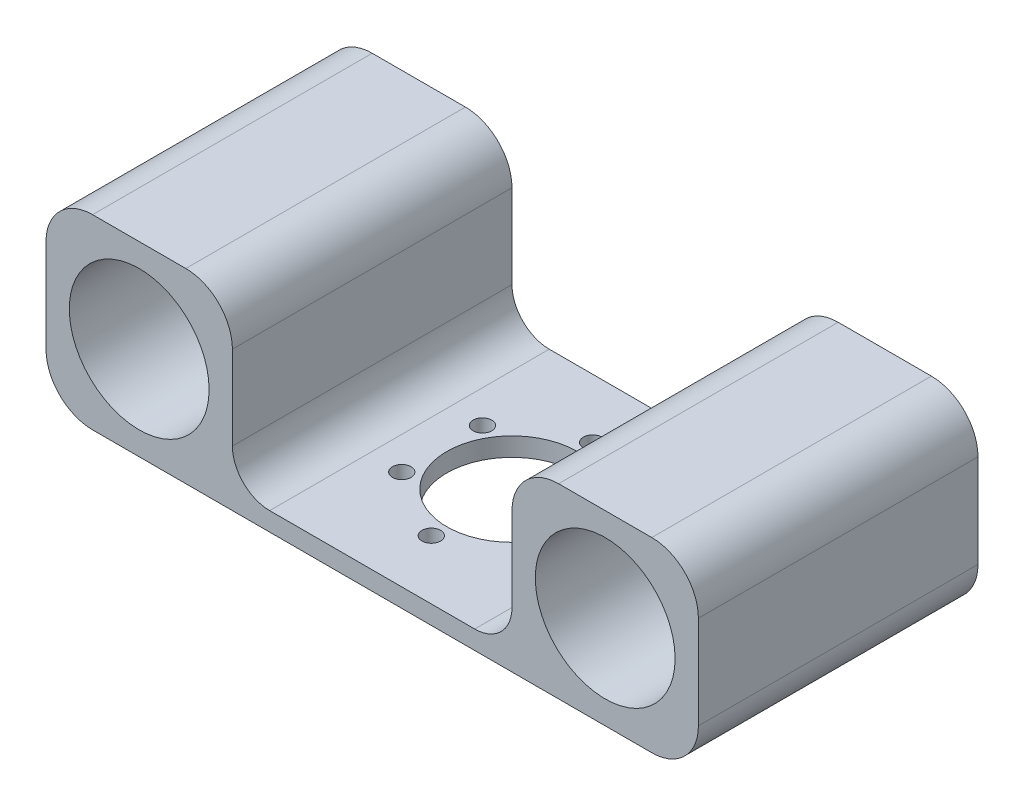
ISO-10303-21;
HEADER;
FILE_DESCRIPTION(('STEP AP214'),'2;1');
FILE_NAME('part.step','',(''),(''),'','','');
FILE_SCHEMA(('AUTOMOTIVE_DESIGN { 1 0 10303 214 1 1 1 1 }'));
ENDSEC;
DATA;
#1=APPLICATION_CONTEXT('core data for automotive mechanical design processes');
#2=APPLICATION_PROTOCOL_DEFINITION('international standard','automotive_design',2000,#1);
#3=PRODUCT_CONTEXT('',#1,'mechanical');
#4=PRODUCT('Part','Part','',(#3));
#5=PRODUCT_RELATED_PRODUCT_CATEGORY('part','',(#4));
#6=PRODUCT_DEFINITION_FORMATION('','',#4);
#7=PRODUCT_DEFINITION_CONTEXT('part definition',#1,'design');
#8=PRODUCT_DEFINITION('design','',#6,#7);
#9=PRODUCT_DEFINITION_SHAPE('','',#8);
#10=(LENGTH_UNIT() NAMED_UNIT(*) SI_UNIT(.MILLI.,.METRE.));
#11=(NAMED_UNIT(*) PLANE_ANGLE_UNIT() SI_UNIT($,.RADIAN.));
#12=(NAMED_UNIT(*) SI_UNIT($,.STERADIAN.) SOLID_ANGLE_UNIT());
#13=UNCERTAINTY_MEASURE_WITH_UNIT(LENGTH_MEASURE(1.E-05),#10,'distance_accuracy_value','');
#14=(GEOMETRIC_REPRESENTATION_CONTEXT(3) GLOBAL_UNCERTAINTY_ASSIGNED_CONTEXT((#13)) GLOBAL_UNIT_ASSIGNED_CONTEXT((#10,
#11,#12)) REPRESENTATION_CONTEXT('',''));
#15=CARTESIAN_POINT('',(0.,0.,0.));
#16=DIRECTION('',(0.,0.,1.));
#17=DIRECTION('',(1.,0.,0.));
#18=AXIS2_PLACEMENT_3D('',#15,#16,#17);
#19=CARTESIAN_POINT('',(46.,6.,15.));
#20=DIRECTION('',(0.,0.,1.));
#21=DIRECTION('',(1.,0.,0.));
#22=AXIS2_PLACEMENT_3D('',#19,#20,#21);
#23=CYLINDRICAL_SURFACE('',#22,4.);
#24=CARTESIAN_POINT('',(46.,6.,0.));
#25=DIRECTION('',(0.,0.,1.));
#26=DIRECTION('',(1.,0.,0.));
#27=AXIS2_PLACEMENT_3D('',#24,#25,#26);
#28=CIRCLE('',#27,4.);
#29=CARTESIAN_POINT('',(46.,2.,0.));
#30=VERTEX_POINT('',#29);
#31=CARTESIAN_POINT('',(50.,6.,0.));
#32=VERTEX_POINT('',#31);
#33=EDGE_CURVE('E11',#30,#32,#28,.T.);
#34=ORIENTED_EDGE('',*,*,#33,.F.);
#35=DIRECTION('',(0.,0.,-1.));
#36=VECTOR('',#35,1.);
#37=CARTESIAN_POINT('',(46.,2.,15.));
#38=LINE('',#37,#36);
#39=CARTESIAN_POINT('',(46.,2.,30.));
#40=VERTEX_POINT('',#39);
#41=EDGE_CURVE('E391',#40,#30,#38,.T.);
#42=ORIENTED_EDGE('',*,*,#41,.F.);
#43=CARTESIAN_POINT('',(46.,6.,30.));
#44=DIRECTION('',(0.,0.,-1.));
#45=DIRECTION('',(1.,0.,0.));
#46=AXIS2_PLACEMENT_3D('',#43,#44,#45);
#47=CIRCLE('',#46,4.);
#48=CARTESIAN_POINT('',(50.,6.,30.));
#49=VERTEX_POINT('',#48);
#50=EDGE_CURVE('E28',#49,#40,#47,.T.);
#51=ORIENTED_EDGE('',*,*,#50,.F.);
#52=DIRECTION('',(0.,0.,-1.));
#53=VECTOR('',#52,1.);
#54=CARTESIAN_POINT('',(50.,6.,15.));
#55=LINE('',#54,#53);
#56=EDGE_CURVE('E37',#49,#32,#55,.T.);
#57=ORIENTED_EDGE('',*,*,#56,.T.);
#58=EDGE_LOOP('',(#34,#42,#51,#57));
#59=FACE_BOUND('',#58,.T.);
#60=ADVANCED_FACE('F17',(#59),#23,.F.);
#61=CARTESIAN_POINT('',(24.,6.,15.));
#62=DIRECTION('',(0.,0.,1.));
#63=DIRECTION('',(1.,0.,0.));
#64=AXIS2_PLACEMENT_3D('',#61,#62,#63);
#65=CYLINDRICAL_SURFACE('',#64,4.);
#66=CARTESIAN_POINT('',(24.,6.,0.));
#67=DIRECTION('',(0.,0.,1.));
#68=DIRECTION('',(1.,0.,0.));
#69=AXIS2_PLACEMENT_3D('',#66,#67,#68);
#70=CIRCLE('',#69,4.);
#71=CARTESIAN_POINT('',(20.,6.,0.));
#72=VERTEX_POINT('',#71);
#73=CARTESIAN_POINT('',(24.,2.,0.));
#74=VERTEX_POINT('',#73);
#75=EDGE_CURVE('E385',#72,#74,#70,.T.);
#76=ORIENTED_EDGE('',*,*,#75,.F.);
#77=DIRECTION('',(0.,0.,-1.));
#78=VECTOR('',#77,1.);
#79=CARTESIAN_POINT('',(20.,6.,15.));
#80=LINE('',#79,#78);
#81=CARTESIAN_POINT('',(20.,6.,30.));
#82=VERTEX_POINT('',#81);
#83=EDGE_CURVE('E375',#82,#72,#80,.T.);
#84=ORIENTED_EDGE('',*,*,#83,.F.);
#85=CARTESIAN_POINT('',(24.,6.,30.));
#86=DIRECTION('',(0.,0.,-1.));
#87=DIRECTION('',(1.,0.,0.));
#88=AXIS2_PLACEMENT_3D('',#85,#86,#87);
#89=CIRCLE('',#88,4.);
#90=CARTESIAN_POINT('',(24.,2.,30.));
#91=VERTEX_POINT('',#90);
#92=EDGE_CURVE('E381',#91,#82,#89,.T.);
#93=ORIENTED_EDGE('',*,*,#92,.F.);
#94=DIRECTION('',(0.,0.,-1.));
#95=VECTOR('',#94,1.);
#96=CARTESIAN_POINT('',(24.,2.,15.));
#97=LINE('',#96,#95);
#98=EDGE_CURVE('E353',#91,#74,#97,.T.);
#99=ORIENTED_EDGE('',*,*,#98,.T.);
#100=EDGE_LOOP('',(#76,#84,#93,#99));
#101=FACE_BOUND('',#100,.T.);
#102=ADVANCED_FACE('F444',(#101),#65,.F.);
#103=CARTESIAN_POINT('',(20.,2.,0.));
#104=DIRECTION('',(0.,-1.,0.));
#105=DIRECTION('',(0.,0.,-1.));
#106=AXIS2_PLACEMENT_3D('',#103,#104,#105);
#107=PLANE('',#106);
#108=DIRECTION('',(-1.,0.,0.));
#109=VECTOR('',#108,1.);
#110=CARTESIAN_POINT('',(35.,2.,0.));
#111=LINE('',#110,#109);
#112=EDGE_CURVE('E256',#30,#74,#111,.T.);
#113=ORIENTED_EDGE('',*,*,#112,.T.);
#114=ORIENTED_EDGE('',*,*,#98,.F.);
#115=DIRECTION('',(-1.,0.,0.));
#116=VECTOR('',#115,1.);
#117=CARTESIAN_POINT('',(35.,2.,30.));
#118=LINE('',#117,#116);
#119=EDGE_CURVE('E371',#40,#91,#118,.T.);
#120=ORIENTED_EDGE('',*,*,#119,.F.);
#121=ORIENTED_EDGE('',*,*,#41,.T.);
#122=EDGE_LOOP('',(#113,#114,#120,#121));
#123=FACE_BOUND('',#122,.T.);
#124=CARTESIAN_POINT('',(35.,2.,15.));
#125=DIRECTION('',(0.,-1.,0.));
#126=DIRECTION('',(0.,0.,-1.));
#127=AXIS2_PLACEMENT_3D('',#124,#125,#126);
#128=CIRCLE('',#127,7.);
#129=CARTESIAN_POINT('',(35.,2.,8.));
#130=VERTEX_POINT('',#129);
#131=EDGE_CURVE('E312',#130,#130,#128,.T.);
#132=ORIENTED_EDGE('',*,*,#131,.T.);
#133=EDGE_LOOP('',(#132));
#134=FACE_BOUND('',#133,.T.);
#135=CARTESIAN_POINT('',(35.,2.,23.6602540378444));
#136=DIRECTION('',(0.,-1.,0.));
#137=DIRECTION('',(0.,0.,-1.));
#138=AXIS2_PLACEMENT_3D('',#135,#136,#137);
#139=CIRCLE('',#138,1.);
#140=CARTESIAN_POINT('',(35.,2.,22.6602540378444));
#141=VERTEX_POINT('',#140);
#142=EDGE_CURVE('E354',#141,#141,#139,.T.);
#143=ORIENTED_EDGE('',*,*,#142,.T.);
#144=EDGE_LOOP('',(#143));
#145=FACE_BOUND('',#144,.T.);
#146=CARTESIAN_POINT('',(42.5,2.,10.6698729810778));
#147=DIRECTION('',(0.,-1.,0.));
#148=DIRECTION('',(0.,0.,-1.));
#149=AXIS2_PLACEMENT_3D('',#146,#147,#148);
#150=CIRCLE('',#149,1.);
#151=CARTESIAN_POINT('',(42.5,2.,9.66987298107781));
#152=VERTEX_POINT('',#151);
#153=EDGE_CURVE('E347',#152,#152,#150,.T.);
#154=ORIENTED_EDGE('',*,*,#153,.T.);
#155=EDGE_LOOP('',(#154));
#156=FACE_BOUND('',#155,.T.);
#157=CARTESIAN_POINT('',(27.5,2.,10.6698729810778));
#158=DIRECTION('',(0.,-1.,0.));
#159=DIRECTION('',(0.,0.,-1.));
#160=AXIS2_PLACEMENT_3D('',#157,#158,#159);
#161=CIRCLE('',#160,1.);
#162=CARTESIAN_POINT('',(27.5,2.,9.66987298107781));
#163=VERTEX_POINT('',#162);
#164=EDGE_CURVE('E348',#163,#163,#161,.T.);
#165=ORIENTED_EDGE('',*,*,#164,.T.);
#166=EDGE_LOOP('',(#165));
#167=FACE_BOUND('',#166,.T.);
#168=CARTESIAN_POINT('',(42.5,2.,19.3301270189222));
#169=DIRECTION('',(0.,-1.,0.));
#170=DIRECTION('',(0.,0.,-1.));
#171=AXIS2_PLACEMENT_3D('',#168,#169,#170);
#172=CIRCLE('',#171,1.);
#173=CARTESIAN_POINT('',(42.5,2.,18.3301270189222));
#174=VERTEX_POINT('',#173);
#175=EDGE_CURVE('E355',#174,#174,#172,.T.);
#176=ORIENTED_EDGE('',*,*,#175,.T.);
#177=EDGE_LOOP('',(#176));
#178=FACE_BOUND('',#177,.T.);
#179=CARTESIAN_POINT('',(27.5,2.,19.3301270189222));
#180=DIRECTION('',(0.,-1.,0.));
#181=DIRECTION('',(0.,0.,-1.));
#182=AXIS2_PLACEMENT_3D('',#179,#180,#181);
#183=CIRCLE('',#182,1.);
#184=CARTESIAN_POINT('',(27.5,2.,18.3301270189222));
#185=VERTEX_POINT('',#184);
#186=EDGE_CURVE('E349',#185,#185,#183,.T.);
#187=ORIENTED_EDGE('',*,*,#186,.T.);
#188=EDGE_LOOP('',(#187));
#189=FACE_BOUND('',#188,.T.);
#190=CARTESIAN_POINT('',(35.,2.,6.33974596215561));
#191=DIRECTION('',(0.,-1.,0.));
#192=DIRECTION('',(0.,0.,-1.));
#193=AXIS2_PLACEMENT_3D('',#190,#191,#192);
#194=CIRCLE('',#193,1.);
#195=CARTESIAN_POINT('',(35.,2.,5.33974596215561));
#196=VERTEX_POINT('',#195);
#197=EDGE_CURVE('E343',#196,#196,#194,.T.);
#198=ORIENTED_EDGE('',*,*,#197,.T.);
#199=EDGE_LOOP('',(#198));
#200=FACE_BOUND('',#199,.T.);
#201=ADVANCED_FACE('F449',(#123,#134,#145,#156,#167,#178,#189,#200),#107,.F.);
#202=CARTESIAN_POINT('',(27.5,8.5,19.3301270189222));
#203=DIRECTION('',(0.,-1.,0.));
#204=DIRECTION('',(0.,0.,-1.));
#205=AXIS2_PLACEMENT_3D('',#202,#203,#204);
#206=CYLINDRICAL_SURFACE('',#205,1.);
#207=ORIENTED_EDGE('',*,*,#186,.F.);
#208=EDGE_LOOP('',(#207));
#209=FACE_BOUND('',#208,.T.);
#210=CARTESIAN_POINT('',(27.5,0.,19.3301270189222));
#211=DIRECTION('',(0.,-1.,0.));
#212=DIRECTION('',(0.,0.,-1.));
#213=AXIS2_PLACEMENT_3D('',#210,#211,#212);
#214=CIRCLE('',#213,1.);
#215=CARTESIAN_POINT('',(27.5,0.,18.3301270189222));
#216=VERTEX_POINT('',#215);
#217=EDGE_CURVE('E330',#216,#216,#214,.T.);
#218=ORIENTED_EDGE('',*,*,#217,.T.);
#219=EDGE_LOOP('',(#218));
#220=FACE_BOUND('',#219,.T.);
#221=ADVANCED_FACE('F455',(#209,#220),#206,.F.);
#222=CARTESIAN_POINT('',(35.,8.5,23.6602540378444));
#223=DIRECTION('',(0.,-1.,0.));
#224=DIRECTION('',(0.,0.,-1.));
#225=AXIS2_PLACEMENT_3D('',#222,#223,#224);
#226=CYLINDRICAL_SURFACE('',#225,1.);
#227=ORIENTED_EDGE('',*,*,#142,.F.);
#228=EDGE_LOOP('',(#227));
#229=FACE_BOUND('',#228,.T.);
#230=CARTESIAN_POINT('',(35.,0.,23.6602540378444));
#231=DIRECTION('',(0.,-1.,0.));
#232=DIRECTION('',(0.,0.,-1.));
#233=AXIS2_PLACEMENT_3D('',#230,#231,#232);
#234=CIRCLE('',#233,1.);
#235=CARTESIAN_POINT('',(35.,0.,22.6602540378444));
#236=VERTEX_POINT('',#235);
#237=EDGE_CURVE('E320',#236,#236,#234,.T.);
#238=ORIENTED_EDGE('',*,*,#237,.T.);
#239=EDGE_LOOP('',(#238));
#240=FACE_BOUND('',#239,.T.);
#241=ADVANCED_FACE('F459',(#229,#240),#226,.F.);
#242=CARTESIAN_POINT('',(42.5,8.5,19.3301270189222));
#243=DIRECTION('',(0.,-1.,0.));
#244=DIRECTION('',(0.,0.,-1.));
#245=AXIS2_PLACEMENT_3D('',#242,#243,#244);
#246=CYLINDRICAL_SURFACE('',#245,1.);
#247=ORIENTED_EDGE('',*,*,#175,.F.);
#248=EDGE_LOOP('',(#247));
#249=FACE_BOUND('',#248,.T.);
#250=CARTESIAN_POINT('',(42.5,0.,19.3301270189222));
#251=DIRECTION('',(0.,-1.,0.));
#252=DIRECTION('',(0.,0.,-1.));
#253=AXIS2_PLACEMENT_3D('',#250,#251,#252);
#254=CIRCLE('',#253,1.);
#255=CARTESIAN_POINT('',(42.5,0.,18.3301270189222));
#256=VERTEX_POINT('',#255);
#257=EDGE_CURVE('E326',#256,#256,#254,.T.);
#258=ORIENTED_EDGE('',*,*,#257,.T.);
#259=EDGE_LOOP('',(#258));
#260=FACE_BOUND('',#259,.T.);
#261=ADVANCED_FACE('F463',(#249,#260),#246,.F.);
#262=CARTESIAN_POINT('',(42.5,8.5,10.6698729810778));
#263=DIRECTION('',(0.,-1.,0.));
#264=DIRECTION('',(0.,0.,-1.));
#265=AXIS2_PLACEMENT_3D('',#262,#263,#264);
#266=CYLINDRICAL_SURFACE('',#265,1.);
#267=ORIENTED_EDGE('',*,*,#153,.F.);
#268=EDGE_LOOP('',(#267));
#269=FACE_BOUND('',#268,.T.);
#270=CARTESIAN_POINT('',(42.5,0.,10.6698729810778));
#271=DIRECTION('',(0.,-1.,0.));
#272=DIRECTION('',(0.,0.,-1.));
#273=AXIS2_PLACEMENT_3D('',#270,#271,#272);
#274=CIRCLE('',#273,1.);
#275=CARTESIAN_POINT('',(42.5,0.,9.66987298107781));
#276=VERTEX_POINT('',#275);
#277=EDGE_CURVE('E325',#276,#276,#274,.T.);
#278=ORIENTED_EDGE('',*,*,#277,.T.);
#279=EDGE_LOOP('',(#278));
#280=FACE_BOUND('',#279,.T.);
#281=ADVANCED_FACE('F467',(#269,#280),#266,.F.);
#282=CARTESIAN_POINT('',(35.,8.5,6.33974596215561));
#283=DIRECTION('',(0.,-1.,0.));
#284=DIRECTION('',(0.,0.,-1.));
#285=AXIS2_PLACEMENT_3D('',#282,#283,#284);
#286=CYLINDRICAL_SURFACE('',#285,1.);
#287=ORIENTED_EDGE('',*,*,#197,.F.);
#288=EDGE_LOOP('',(#287));
#289=FACE_BOUND('',#288,.T.);
#290=CARTESIAN_POINT('',(35.,0.,6.33974596215561));
#291=DIRECTION('',(0.,-1.,0.));
#292=DIRECTION('',(0.,0.,-1.));
#293=AXIS2_PLACEMENT_3D('',#290,#291,#292);
#294=CIRCLE('',#293,1.);
#295=CARTESIAN_POINT('',(35.,0.,5.33974596215561));
#296=VERTEX_POINT('',#295);
#297=EDGE_CURVE('E226',#296,#296,#294,.T.);
#298=ORIENTED_EDGE('',*,*,#297,.T.);
#299=EDGE_LOOP('',(#298));
#300=FACE_BOUND('',#299,.T.);
#301=ADVANCED_FACE('F471',(#289,#300),#286,.F.);
#302=CARTESIAN_POINT('',(27.5,8.5,10.6698729810778));
#303=DIRECTION('',(0.,-1.,0.));
#304=DIRECTION('',(0.,0.,-1.));
#305=AXIS2_PLACEMENT_3D('',#302,#303,#304);
#306=CYLINDRICAL_SURFACE('',#305,1.);
#307=ORIENTED_EDGE('',*,*,#164,.F.);
#308=EDGE_LOOP('',(#307));
#309=FACE_BOUND('',#308,.T.);
#310=CARTESIAN_POINT('',(27.5,0.,10.6698729810778));
#311=DIRECTION('',(0.,-1.,0.));
#312=DIRECTION('',(0.,0.,-1.));
#313=AXIS2_PLACEMENT_3D('',#310,#311,#312);
#314=CIRCLE('',#313,1.);
#315=CARTESIAN_POINT('',(27.5,0.,9.66987298107781));
#316=VERTEX_POINT('',#315);
#317=EDGE_CURVE('E321',#316,#316,#314,.T.);
#318=ORIENTED_EDGE('',*,*,#317,.T.);
#319=EDGE_LOOP('',(#318));
#320=FACE_BOUND('',#319,.T.);
#321=ADVANCED_FACE('F475',(#309,#320),#306,.F.);
#322=CARTESIAN_POINT('',(35.,8.5,15.));
#323=DIRECTION('',(0.,-1.,0.));
#324=DIRECTION('',(0.,0.,-1.));
#325=AXIS2_PLACEMENT_3D('',#322,#323,#324);
#326=CYLINDRICAL_SURFACE('',#325,7.);
#327=ORIENTED_EDGE('',*,*,#131,.F.);
#328=EDGE_LOOP('',(#327));
#329=FACE_BOUND('',#328,.T.);
#330=CARTESIAN_POINT('',(35.,0.,15.));
#331=DIRECTION('',(0.,-1.,0.));
#332=DIRECTION('',(0.,0.,-1.));
#333=AXIS2_PLACEMENT_3D('',#330,#331,#332);
#334=CIRCLE('',#333,7.);
#335=CARTESIAN_POINT('',(35.,0.,8.));
#336=VERTEX_POINT('',#335);
#337=EDGE_CURVE('E213',#336,#336,#334,.T.);
#338=ORIENTED_EDGE('',*,*,#337,.T.);
#339=EDGE_LOOP('',(#338));
#340=FACE_BOUND('',#339,.T.);
#341=ADVANCED_FACE('F479',(#329,#340),#326,.F.);
#342=CARTESIAN_POINT('',(65.,5.,15.));
#343=DIRECTION('',(0.,0.,1.));
#344=DIRECTION('',(1.,0.,0.));
#345=AXIS2_PLACEMENT_3D('',#342,#343,#344);
#346=CYLINDRICAL_SURFACE('',#345,5.);
#347=DIRECTION('',(0.,0.,1.));
#348=VECTOR('',#347,1.);
#349=CARTESIAN_POINT('',(70.,5.,15.));
#350=LINE('',#349,#348);
#351=CARTESIAN_POINT('',(70.,5.,0.));
#352=VERTEX_POINT('',#351);
#353=CARTESIAN_POINT('',(70.,5.,30.));
#354=VERTEX_POINT('',#353);
#355=EDGE_CURVE('E303',#352,#354,#350,.T.);
#356=ORIENTED_EDGE('',*,*,#355,.T.);
#357=CARTESIAN_POINT('',(65.,5.,30.));
#358=DIRECTION('',(0.,0.,-1.));
#359=DIRECTION('',(1.,0.,0.));
#360=AXIS2_PLACEMENT_3D('',#357,#358,#359);
#361=CIRCLE('',#360,5.);
#362=CARTESIAN_POINT('',(65.,0.,30.));
#363=VERTEX_POINT('',#362);
#364=EDGE_CURVE('E176',#354,#363,#361,.T.);
#365=ORIENTED_EDGE('',*,*,#364,.T.);
#366=DIRECTION('',(0.,0.,1.));
#367=VECTOR('',#366,1.);
#368=CARTESIAN_POINT('',(65.,0.,15.));
#369=LINE('',#368,#367);
#370=CARTESIAN_POINT('',(65.,0.,0.));
#371=VERTEX_POINT('',#370);
#372=EDGE_CURVE('E308',#371,#363,#369,.T.);
#373=ORIENTED_EDGE('',*,*,#372,.F.);
#374=CARTESIAN_POINT('',(65.,5.,0.));
#375=DIRECTION('',(0.,0.,1.));
#376=DIRECTION('',(1.,0.,0.));
#377=AXIS2_PLACEMENT_3D('',#374,#375,#376);
#378=CIRCLE('',#377,5.);
#379=EDGE_CURVE('E217',#371,#352,#378,.T.);
#380=ORIENTED_EDGE('',*,*,#379,.T.);
#381=EDGE_LOOP('',(#356,#365,#373,#380));
#382=FACE_BOUND('',#381,.T.);
#383=ADVANCED_FACE('F483',(#382),#346,.T.);
#384=CARTESIAN_POINT('',(70.,20.,0.));
#385=DIRECTION('',(-1.,0.,0.));
#386=DIRECTION('',(0.,0.,1.));
#387=AXIS2_PLACEMENT_3D('',#384,#385,#386);
#388=PLANE('',#387);
#389=DIRECTION('',(0.,1.,0.));
#390=VECTOR('',#389,1.);
#391=CARTESIAN_POINT('',(70.,10.,0.));
#392=LINE('',#391,#390);
#393=CARTESIAN_POINT('',(70.,15.,0.));
#394=VERTEX_POINT('',#393);
#395=EDGE_CURVE('E293',#352,#394,#392,.T.);
#396=ORIENTED_EDGE('',*,*,#395,.T.);
#397=DIRECTION('',(0.,0.,1.));
#398=VECTOR('',#397,1.);
#399=CARTESIAN_POINT('',(70.,15.,15.));
#400=LINE('',#399,#398);
#401=CARTESIAN_POINT('',(70.,15.,30.));
#402=VERTEX_POINT('',#401);
#403=EDGE_CURVE('E287',#394,#402,#400,.T.);
#404=ORIENTED_EDGE('',*,*,#403,.T.);
#405=DIRECTION('',(0.,1.,0.));
#406=VECTOR('',#405,1.);
#407=CARTESIAN_POINT('',(70.,10.,30.));
#408=LINE('',#407,#406);
#409=EDGE_CURVE('E299',#354,#402,#408,.T.);
#410=ORIENTED_EDGE('',*,*,#409,.F.);
#411=ORIENTED_EDGE('',*,*,#355,.F.);
#412=EDGE_LOOP('',(#396,#404,#410,#411));
#413=FACE_BOUND('',#412,.T.);
#414=ADVANCED_FACE('F487',(#413),#388,.F.);
#415=CARTESIAN_POINT('',(65.,15.,15.));
#416=DIRECTION('',(0.,0.,1.));
#417=DIRECTION('',(1.,0.,0.));
#418=AXIS2_PLACEMENT_3D('',#415,#416,#417);
#419=CYLINDRICAL_SURFACE('',#418,5.);
#420=DIRECTION('',(0.,0.,1.));
#421=VECTOR('',#420,1.);
#422=CARTESIAN_POINT('',(65.,20.,15.));
#423=LINE('',#422,#421);
#424=CARTESIAN_POINT('',(65.,20.,0.));
#425=VERTEX_POINT('',#424);
#426=CARTESIAN_POINT('',(65.,20.,30.));
#427=VERTEX_POINT('',#426);
#428=EDGE_CURVE('E273',#425,#427,#423,.T.);
#429=ORIENTED_EDGE('',*,*,#428,.T.);
#430=CARTESIAN_POINT('',(65.,15.,30.));
#431=DIRECTION('',(0.,0.,-1.));
#432=DIRECTION('',(1.,0.,0.));
#433=AXIS2_PLACEMENT_3D('',#430,#431,#432);
#434=CIRCLE('',#433,5.);
#435=EDGE_CURVE('E260',#427,#402,#434,.T.);
#436=ORIENTED_EDGE('',*,*,#435,.T.);
#437=ORIENTED_EDGE('',*,*,#403,.F.);
#438=CARTESIAN_POINT('',(65.,15.,0.));
#439=DIRECTION('',(0.,0.,1.));
#440=DIRECTION('',(1.,0.,0.));
#441=AXIS2_PLACEMENT_3D('',#438,#439,#440);
#442=CIRCLE('',#441,5.);
#443=EDGE_CURVE('E276',#394,#425,#442,.T.);
#444=ORIENTED_EDGE('',*,*,#443,.T.);
#445=EDGE_LOOP('',(#429,#436,#437,#444));
#446=FACE_BOUND('',#445,.T.);
#447=ADVANCED_FACE('F491',(#446),#419,.T.);
#448=CARTESIAN_POINT('',(50.,2.,0.));
#449=DIRECTION('',(1.,0.,0.));
#450=DIRECTION('',(0.,0.,-1.));
#451=AXIS2_PLACEMENT_3D('',#448,#449,#450);
#452=PLANE('',#451);
#453=DIRECTION('',(0.,-1.,0.));
#454=VECTOR('',#453,1.);
#455=CARTESIAN_POINT('',(50.,10.5,30.));
#456=LINE('',#455,#454);
#457=CARTESIAN_POINT('',(50.,15.,30.));
#458=VERTEX_POINT('',#457);
#459=EDGE_CURVE('E283',#458,#49,#456,.T.);
#460=ORIENTED_EDGE('',*,*,#459,.F.);
#461=DIRECTION('',(0.,0.,1.));
#462=VECTOR('',#461,1.);
#463=CARTESIAN_POINT('',(50.,15.,15.));
#464=LINE('',#463,#462);
#465=CARTESIAN_POINT('',(50.,15.,0.));
#466=VERTEX_POINT('',#465);
#467=EDGE_CURVE('E277',#466,#458,#464,.T.);
#468=ORIENTED_EDGE('',*,*,#467,.F.);
#469=DIRECTION('',(0.,-1.,0.));
#470=VECTOR('',#469,1.);
#471=CARTESIAN_POINT('',(50.,10.5,0.));
#472=LINE('',#471,#470);
#473=EDGE_CURVE('E266',#466,#32,#472,.T.);
#474=ORIENTED_EDGE('',*,*,#473,.T.);
#475=ORIENTED_EDGE('',*,*,#56,.F.);
#476=EDGE_LOOP('',(#460,#468,#474,#475));
#477=FACE_BOUND('',#476,.T.);
#478=ADVANCED_FACE('F495',(#477),#452,.F.);
#479=CARTESIAN_POINT('',(50.,20.,0.));
#480=DIRECTION('',(0.,-1.,0.));
#481=DIRECTION('',(0.,0.,-1.));
#482=AXIS2_PLACEMENT_3D('',#479,#480,#481);
#483=PLANE('',#482);
#484=DIRECTION('',(-1.,0.,0.));
#485=VECTOR('',#484,1.);
#486=CARTESIAN_POINT('',(60.,20.,0.));
#487=LINE('',#486,#485);
#488=CARTESIAN_POINT('',(55.,20.,0.));
#489=VERTEX_POINT('',#488);
#490=EDGE_CURVE('E265',#425,#489,#487,.T.);
#491=ORIENTED_EDGE('',*,*,#490,.T.);
#492=DIRECTION('',(0.,0.,1.));
#493=VECTOR('',#492,1.);
#494=CARTESIAN_POINT('',(55.,20.,15.));
#495=LINE('',#494,#493);
#496=CARTESIAN_POINT('',(55.,20.,30.));
#497=VERTEX_POINT('',#496);
#498=EDGE_CURVE('E253',#489,#497,#495,.T.);
#499=ORIENTED_EDGE('',*,*,#498,.T.);
#500=DIRECTION('',(-1.,0.,0.));
#501=VECTOR('',#500,1.);
#502=CARTESIAN_POINT('',(60.,20.,30.));
#503=LINE('',#502,#501);
#504=EDGE_CURVE('E269',#427,#497,#503,.T.);
#505=ORIENTED_EDGE('',*,*,#504,.F.);
#506=ORIENTED_EDGE('',*,*,#428,.F.);
#507=EDGE_LOOP('',(#491,#499,#505,#506));
#508=FACE_BOUND('',#507,.T.);
#509=ADVANCED_FACE('F499',(#508),#483,.F.);
#510=CARTESIAN_POINT('',(55.,15.,15.));
#511=DIRECTION('',(0.,0.,1.));
#512=DIRECTION('',(1.,0.,0.));
#513=AXIS2_PLACEMENT_3D('',#510,#511,#512);
#514=CYLINDRICAL_SURFACE('',#513,5.);
#515=ORIENTED_EDGE('',*,*,#467,.T.);
#516=CARTESIAN_POINT('',(55.,15.,30.));
#517=DIRECTION('',(0.,0.,-1.));
#518=DIRECTION('',(1.,0.,0.));
#519=AXIS2_PLACEMENT_3D('',#516,#517,#518);
#520=CIRCLE('',#519,5.);
#521=EDGE_CURVE('E239',#458,#497,#520,.T.);
#522=ORIENTED_EDGE('',*,*,#521,.T.);
#523=ORIENTED_EDGE('',*,*,#498,.F.);
#524=CARTESIAN_POINT('',(55.,15.,0.));
#525=DIRECTION('',(0.,0.,1.));
#526=DIRECTION('',(1.,0.,0.));
#527=AXIS2_PLACEMENT_3D('',#524,#525,#526);
#528=CIRCLE('',#527,5.);
#529=EDGE_CURVE('E261',#489,#466,#528,.T.);
#530=ORIENTED_EDGE('',*,*,#529,.T.);
#531=EDGE_LOOP('',(#515,#522,#523,#530));
#532=FACE_BOUND('',#531,.T.);
#533=ADVANCED_FACE('F503',(#532),#514,.T.);
#534=CARTESIAN_POINT('',(20.,20.,0.));
#535=DIRECTION('',(-1.,0.,0.));
#536=DIRECTION('',(0.,0.,1.));
#537=AXIS2_PLACEMENT_3D('',#534,#535,#536);
#538=PLANE('',#537);
#539=DIRECTION('',(0.,1.,0.));
#540=VECTOR('',#539,1.);
#541=CARTESIAN_POINT('',(20.,10.5,0.));
#542=LINE('',#541,#540);
#543=CARTESIAN_POINT('',(20.,15.,0.));
#544=VERTEX_POINT('',#543);
#545=EDGE_CURVE('E242',#72,#544,#542,.T.);
#546=ORIENTED_EDGE('',*,*,#545,.T.);
#547=DIRECTION('',(0.,0.,1.));
#548=VECTOR('',#547,1.);
#549=CARTESIAN_POINT('',(20.,15.,15.));
#550=LINE('',#549,#548);
#551=CARTESIAN_POINT('',(20.,15.,30.));
#552=VERTEX_POINT('',#551);
#553=EDGE_CURVE('E246',#544,#552,#550,.T.);
#554=ORIENTED_EDGE('',*,*,#553,.T.);
#555=DIRECTION('',(0.,1.,0.));
#556=VECTOR('',#555,1.);
#557=CARTESIAN_POINT('',(20.,10.5,30.));
#558=LINE('',#557,#556);
#559=EDGE_CURVE('E249',#82,#552,#558,.T.);
#560=ORIENTED_EDGE('',*,*,#559,.F.);
#561=ORIENTED_EDGE('',*,*,#83,.T.);
#562=EDGE_LOOP('',(#546,#554,#560,#561));
#563=FACE_BOUND('',#562,.T.);
#564=ADVANCED_FACE('F507',(#563),#538,.F.);
#565=CARTESIAN_POINT('',(15.,15.,15.));
#566=DIRECTION('',(0.,0.,1.));
#567=DIRECTION('',(1.,0.,0.));
#568=AXIS2_PLACEMENT_3D('',#565,#566,#567);
#569=CYLINDRICAL_SURFACE('',#568,5.);
#570=DIRECTION('',(0.,0.,1.));
#571=VECTOR('',#570,1.);
#572=CARTESIAN_POINT('',(15.,20.,15.));
#573=LINE('',#572,#571);
#574=CARTESIAN_POINT('',(15.,20.,0.));
#575=VERTEX_POINT('',#574);
#576=CARTESIAN_POINT('',(15.,20.,30.));
#577=VERTEX_POINT('',#576);
#578=EDGE_CURVE('E232',#575,#577,#573,.T.);
#579=ORIENTED_EDGE('',*,*,#578,.T.);
#580=CARTESIAN_POINT('',(15.,15.,30.));
#581=DIRECTION('',(0.,0.,-1.));
#582=DIRECTION('',(1.,0.,0.));
#583=AXIS2_PLACEMENT_3D('',#580,#581,#582);
#584=CIRCLE('',#583,5.);
#585=EDGE_CURVE('E166',#577,#552,#584,.T.);
#586=ORIENTED_EDGE('',*,*,#585,.T.);
#587=ORIENTED_EDGE('',*,*,#553,.F.);
#588=CARTESIAN_POINT('',(15.,15.,0.));
#589=DIRECTION('',(0.,0.,1.));
#590=DIRECTION('',(1.,0.,0.));
#591=AXIS2_PLACEMENT_3D('',#588,#589,#590);
#592=CIRCLE('',#591,5.);
#593=EDGE_CURVE('E235',#544,#575,#592,.T.);
#594=ORIENTED_EDGE('',*,*,#593,.T.);
#595=EDGE_LOOP('',(#579,#586,#587,#594));
#596=FACE_BOUND('',#595,.T.);
#597=ADVANCED_FACE('F511',(#596),#569,.T.);
#598=CARTESIAN_POINT('',(50.,20.,0.));
#599=DIRECTION('',(0.,-1.,0.));
#600=DIRECTION('',(0.,0.,-1.));
#601=AXIS2_PLACEMENT_3D('',#598,#599,#600);
#602=PLANE('',#601);
#603=DIRECTION('',(-1.,0.,0.));
#604=VECTOR('',#603,1.);
#605=CARTESIAN_POINT('',(10.,20.,0.));
#606=LINE('',#605,#604);
#607=CARTESIAN_POINT('',(5.,20.,0.));
#608=VERTEX_POINT('',#607);
#609=EDGE_CURVE('E223',#575,#608,#606,.T.);
#610=ORIENTED_EDGE('',*,*,#609,.T.);
#611=DIRECTION('',(0.,0.,1.));
#612=VECTOR('',#611,1.);
#613=CARTESIAN_POINT('',(5.,20.,15.));
#614=LINE('',#613,#612);
#615=CARTESIAN_POINT('',(5.,20.,30.));
#616=VERTEX_POINT('',#615);
#617=EDGE_CURVE('E219',#608,#616,#614,.T.);
#618=ORIENTED_EDGE('',*,*,#617,.T.);
#619=DIRECTION('',(-1.,0.,0.));
#620=VECTOR('',#619,1.);
#621=CARTESIAN_POINT('',(10.,20.,30.));
#622=LINE('',#621,#620);
#623=EDGE_CURVE('E229',#577,#616,#622,.T.);
#624=ORIENTED_EDGE('',*,*,#623,.F.);
#625=ORIENTED_EDGE('',*,*,#578,.F.);
#626=EDGE_LOOP('',(#610,#618,#624,#625));
#627=FACE_BOUND('',#626,.T.);
#628=ADVANCED_FACE('F515',(#627),#602,.F.);
#629=CARTESIAN_POINT('',(5.,15.,15.));
#630=DIRECTION('',(0.,0.,1.));
#631=DIRECTION('',(1.,0.,0.));
#632=AXIS2_PLACEMENT_3D('',#629,#630,#631);
#633=CYLINDRICAL_SURFACE('',#632,5.);
#634=DIRECTION('',(0.,0.,1.));
#635=VECTOR('',#634,1.);
#636=CARTESIAN_POINT('',(0.,15.,15.));
#637=LINE('',#636,#635);
#638=CARTESIAN_POINT('',(0.,15.,0.));
#639=VERTEX_POINT('',#638);
#640=CARTESIAN_POINT('',(0.,15.,30.));
#641=VERTEX_POINT('',#640);
#642=EDGE_CURVE('E153',#639,#641,#637,.T.);
#643=ORIENTED_EDGE('',*,*,#642,.T.);
#644=CARTESIAN_POINT('',(5.,15.,30.));
#645=DIRECTION('',(0.,0.,-1.));
#646=DIRECTION('',(1.,0.,0.));
#647=AXIS2_PLACEMENT_3D('',#644,#645,#646);
#648=CIRCLE('',#647,5.);
#649=EDGE_CURVE('E150',#641,#616,#648,.T.);
#650=ORIENTED_EDGE('',*,*,#649,.T.);
#651=ORIENTED_EDGE('',*,*,#617,.F.);
#652=CARTESIAN_POINT('',(5.,15.,0.));
#653=DIRECTION('',(0.,0.,1.));
#654=DIRECTION('',(1.,0.,0.));
#655=AXIS2_PLACEMENT_3D('',#652,#653,#654);
#656=CIRCLE('',#655,5.);
#657=EDGE_CURVE('E209',#608,#639,#656,.T.);
#658=ORIENTED_EDGE('',*,*,#657,.T.);
#659=EDGE_LOOP('',(#643,#650,#651,#658));
#660=FACE_BOUND('',#659,.T.);
#661=ADVANCED_FACE('F519',(#660),#633,.T.);
#662=CARTESIAN_POINT('',(70.,0.,0.));
#663=DIRECTION('',(0.,1.,0.));
#664=DIRECTION('',(0.,0.,1.));
#665=AXIS2_PLACEMENT_3D('',#662,#663,#664);
#666=PLANE('',#665);
#667=DIRECTION('',(1.,0.,0.));
#668=VECTOR('',#667,1.);
#669=CARTESIAN_POINT('',(35.,0.,30.));
#670=LINE('',#669,#668);
#671=CARTESIAN_POINT('',(5.,0.,30.));
#672=VERTEX_POINT('',#671);
#673=EDGE_CURVE('E212',#672,#363,#670,.T.);
#674=ORIENTED_EDGE('',*,*,#673,.F.);
#675=DIRECTION('',(0.,0.,1.));
#676=VECTOR('',#675,1.);
#677=CARTESIAN_POINT('',(5.,0.,15.));
#678=LINE('',#677,#676);
#679=CARTESIAN_POINT('',(5.,0.,0.));
#680=VERTEX_POINT('',#679);
#681=EDGE_CURVE('E158',#680,#672,#678,.T.);
#682=ORIENTED_EDGE('',*,*,#681,.F.);
#683=DIRECTION('',(1.,0.,0.));
#684=VECTOR('',#683,1.);
#685=CARTESIAN_POINT('',(35.,0.,0.));
#686=LINE('',#685,#684);
#687=EDGE_CURVE('E154',#680,#371,#686,.T.);
#688=ORIENTED_EDGE('',*,*,#687,.T.);
#689=ORIENTED_EDGE('',*,*,#372,.T.);
#690=EDGE_LOOP('',(#674,#682,#688,#689));
#691=FACE_BOUND('',#690,.T.);
#692=ORIENTED_EDGE('',*,*,#337,.F.);
#693=EDGE_LOOP('',(#692));
#694=FACE_BOUND('',#693,.T.);
#695=ORIENTED_EDGE('',*,*,#237,.F.);
#696=EDGE_LOOP('',(#695));
#697=FACE_BOUND('',#696,.T.);
#698=ORIENTED_EDGE('',*,*,#277,.F.);
#699=EDGE_LOOP('',(#698));
#700=FACE_BOUND('',#699,.T.);
#701=ORIENTED_EDGE('',*,*,#317,.F.);
#702=EDGE_LOOP('',(#701));
#703=FACE_BOUND('',#702,.T.);
#704=ORIENTED_EDGE('',*,*,#257,.F.);
#705=EDGE_LOOP('',(#704));
#706=FACE_BOUND('',#705,.T.);
#707=ORIENTED_EDGE('',*,*,#217,.F.);
#708=EDGE_LOOP('',(#707));
#709=FACE_BOUND('',#708,.T.);
#710=ORIENTED_EDGE('',*,*,#297,.F.);
#711=EDGE_LOOP('',(#710));
#712=FACE_BOUND('',#711,.T.);
#713=ADVANCED_FACE('F523',(#691,#694,#697,#700,#703,#706,#709,#712),#666,.F.);
#714=CARTESIAN_POINT('',(0.,0.,0.));
#715=DIRECTION('',(1.,0.,0.));
#716=DIRECTION('',(0.,0.,-1.));
#717=AXIS2_PLACEMENT_3D('',#714,#715,#716);
#718=PLANE('',#717);
#719=DIRECTION('',(0.,-1.,0.));
#720=VECTOR('',#719,1.);
#721=CARTESIAN_POINT('',(0.,10.,0.));
#722=LINE('',#721,#720);
#723=CARTESIAN_POINT('',(0.,5.,0.));
#724=VERTEX_POINT('',#723);
#725=EDGE_CURVE('E137',#639,#724,#722,.T.);
#726=ORIENTED_EDGE('',*,*,#725,.T.);
#727=DIRECTION('',(0.,0.,1.));
#728=VECTOR('',#727,1.);
#729=CARTESIAN_POINT('',(0.,5.,15.));
#730=LINE('',#729,#728);
#731=CARTESIAN_POINT('',(0.,5.,30.));
#732=VERTEX_POINT('',#731);
#733=EDGE_CURVE('E128',#724,#732,#730,.T.);
#734=ORIENTED_EDGE('',*,*,#733,.T.);
#735=DIRECTION('',(0.,-1.,0.));
#736=VECTOR('',#735,1.);
#737=CARTESIAN_POINT('',(0.,10.,30.));
#738=LINE('',#737,#736);
#739=EDGE_CURVE('E135',#641,#732,#738,.T.);
#740=ORIENTED_EDGE('',*,*,#739,.F.);
#741=ORIENTED_EDGE('',*,*,#642,.F.);
#742=EDGE_LOOP('',(#726,#734,#740,#741));
#743=FACE_BOUND('',#742,.T.);
#744=ADVANCED_FACE('F133',(#743),#718,.F.);
#745=CARTESIAN_POINT('',(0.,0.,0.));
#746=DIRECTION('',(0.,0.,1.));
#747=DIRECTION('',(1.,0.,0.));
#748=AXIS2_PLACEMENT_3D('',#745,#746,#747);
#749=PLANE('',#748);
#750=ORIENTED_EDGE('',*,*,#687,.F.);
#751=CARTESIAN_POINT('',(5.,5.,0.));
#752=DIRECTION('',(0.,0.,1.));
#753=DIRECTION('',(1.,0.,0.));
#754=AXIS2_PLACEMENT_3D('',#751,#752,#753);
#755=CIRCLE('',#754,5.);
#756=EDGE_CURVE('E140',#724,#680,#755,.T.);
#757=ORIENTED_EDGE('',*,*,#756,.F.);
#758=ORIENTED_EDGE('',*,*,#725,.F.);
#759=ORIENTED_EDGE('',*,*,#657,.F.);
#760=ORIENTED_EDGE('',*,*,#609,.F.);
#761=ORIENTED_EDGE('',*,*,#593,.F.);
#762=ORIENTED_EDGE('',*,*,#545,.F.);
#763=ORIENTED_EDGE('',*,*,#75,.T.);
#764=ORIENTED_EDGE('',*,*,#112,.F.);
#765=ORIENTED_EDGE('',*,*,#33,.T.);
#766=ORIENTED_EDGE('',*,*,#473,.F.);
#767=ORIENTED_EDGE('',*,*,#529,.F.);
#768=ORIENTED_EDGE('',*,*,#490,.F.);
#769=ORIENTED_EDGE('',*,*,#443,.F.);
#770=ORIENTED_EDGE('',*,*,#395,.F.);
#771=ORIENTED_EDGE('',*,*,#379,.F.);
#772=EDGE_LOOP('',(#750,#757,#758,#759,#760,#761,#762,#763,#764,#765,#766,#767,#768,#769,#770,#771));
#773=FACE_BOUND('',#772,.T.);
#774=CARTESIAN_POINT('',(60.,10.,0.));
#775=DIRECTION('',(0.,0.,1.));
#776=DIRECTION('',(1.,0.,0.));
#777=AXIS2_PLACEMENT_3D('',#774,#775,#776);
#778=CIRCLE('',#777,4.);
#779=CARTESIAN_POINT('',(64.,10.,0.));
#780=VERTEX_POINT('',#779);
#781=EDGE_CURVE('E191',#780,#780,#778,.T.);
#782=ORIENTED_EDGE('',*,*,#781,.T.);
#783=EDGE_LOOP('',(#782));
#784=FACE_BOUND('',#783,.T.);
#785=CARTESIAN_POINT('',(10.,10.,0.));
#786=DIRECTION('',(0.,0.,1.));
#787=DIRECTION('',(1.,0.,0.));
#788=AXIS2_PLACEMENT_3D('',#785,#786,#787);
#789=CIRCLE('',#788,4.);
#790=CARTESIAN_POINT('',(14.,10.,0.));
#791=VERTEX_POINT('',#790);
#792=EDGE_CURVE('E170',#791,#791,#789,.T.);
#793=ORIENTED_EDGE('',*,*,#792,.T.);
#794=EDGE_LOOP('',(#793));
#795=FACE_BOUND('',#794,.T.);
#796=ADVANCED_FACE('F441',(#773,#784,#795),#749,.F.);
#797=CARTESIAN_POINT('',(5.,5.,15.));
#798=DIRECTION('',(0.,0.,1.));
#799=DIRECTION('',(1.,0.,0.));
#800=AXIS2_PLACEMENT_3D('',#797,#798,#799);
#801=CYLINDRICAL_SURFACE('',#800,5.);
#802=ORIENTED_EDGE('',*,*,#681,.T.);
#803=CARTESIAN_POINT('',(5.,5.,30.));
#804=DIRECTION('',(0.,0.,-1.));
#805=DIRECTION('',(1.,0.,0.));
#806=AXIS2_PLACEMENT_3D('',#803,#804,#805);
#807=CIRCLE('',#806,5.);
#808=EDGE_CURVE('E141',#672,#732,#807,.T.);
#809=ORIENTED_EDGE('',*,*,#808,.T.);
#810=ORIENTED_EDGE('',*,*,#733,.F.);
#811=ORIENTED_EDGE('',*,*,#756,.T.);
#812=EDGE_LOOP('',(#802,#809,#810,#811));
#813=FACE_BOUND('',#812,.T.);
#814=ADVANCED_FACE('F156',(#813),#801,.T.);
#815=CARTESIAN_POINT('',(0.,0.,30.));
#816=DIRECTION('',(0.,0.,1.));
#817=DIRECTION('',(1.,0.,0.));
#818=AXIS2_PLACEMENT_3D('',#815,#816,#817);
#819=PLANE('',#818);
#820=ORIENTED_EDGE('',*,*,#808,.F.);
#821=ORIENTED_EDGE('',*,*,#673,.T.);
#822=ORIENTED_EDGE('',*,*,#364,.F.);
#823=ORIENTED_EDGE('',*,*,#409,.T.);
#824=ORIENTED_EDGE('',*,*,#435,.F.);
#825=ORIENTED_EDGE('',*,*,#504,.T.);
#826=ORIENTED_EDGE('',*,*,#521,.F.);
#827=ORIENTED_EDGE('',*,*,#459,.T.);
#828=ORIENTED_EDGE('',*,*,#50,.T.);
#829=ORIENTED_EDGE('',*,*,#119,.T.);
#830=ORIENTED_EDGE('',*,*,#92,.T.);
#831=ORIENTED_EDGE('',*,*,#559,.T.);
#832=ORIENTED_EDGE('',*,*,#585,.F.);
#833=ORIENTED_EDGE('',*,*,#623,.T.);
#834=ORIENTED_EDGE('',*,*,#649,.F.);
#835=ORIENTED_EDGE('',*,*,#739,.T.);
#836=EDGE_LOOP('',(#820,#821,#822,#823,#824,#825,#826,#827,#828,#829,#830,#831,#832,#833,#834,#835));
#837=FACE_BOUND('',#836,.T.);
#838=CARTESIAN_POINT('',(10.,10.,30.));
#839=DIRECTION('',(0.,0.,1.));
#840=DIRECTION('',(1.,0.,0.));
#841=AXIS2_PLACEMENT_3D('',#838,#839,#840);
#842=CIRCLE('',#841,7.5);
#843=CARTESIAN_POINT('',(17.5,10.,30.));
#844=VERTEX_POINT('',#843);
#845=EDGE_CURVE('E172',#844,#844,#842,.T.);
#846=ORIENTED_EDGE('',*,*,#845,.F.);
#847=EDGE_LOOP('',(#846));
#848=FACE_BOUND('',#847,.T.);
#849=CARTESIAN_POINT('',(60.,10.,30.));
#850=DIRECTION('',(0.,0.,1.));
#851=DIRECTION('',(1.,0.,0.));
#852=AXIS2_PLACEMENT_3D('',#849,#850,#851);
#853=CIRCLE('',#852,7.5);
#854=CARTESIAN_POINT('',(67.5,10.,30.));
#855=VERTEX_POINT('',#854);
#856=EDGE_CURVE('E177',#855,#855,#853,.T.);
#857=ORIENTED_EDGE('',*,*,#856,.F.);
#858=EDGE_LOOP('',(#857));
#859=FACE_BOUND('',#858,.T.);
#860=ADVANCED_FACE('F145',(#837,#848,#859),#819,.T.);
#861=CARTESIAN_POINT('',(10.,10.,15.));
#862=DIRECTION('',(0.,0.,1.));
#863=DIRECTION('',(1.,0.,0.));
#864=AXIS2_PLACEMENT_3D('',#861,#862,#863);
#865=CYLINDRICAL_SURFACE('',#864,4.);
#866=CARTESIAN_POINT('',(10.,10.,5.));
#867=DIRECTION('',(0.,0.,1.));
#868=DIRECTION('',(1.,0.,0.));
#869=AXIS2_PLACEMENT_3D('',#866,#867,#868);
#870=CIRCLE('',#869,4.);
#871=CARTESIAN_POINT('',(14.,10.,5.));
#872=VERTEX_POINT('',#871);
#873=EDGE_CURVE('E181',#872,#872,#870,.T.);
#874=ORIENTED_EDGE('',*,*,#873,.T.);
#875=EDGE_LOOP('',(#874));
#876=FACE_BOUND('',#875,.T.);
#877=ORIENTED_EDGE('',*,*,#792,.F.);
#878=EDGE_LOOP('',(#877));
#879=FACE_BOUND('',#878,.T.);
#880=ADVANCED_FACE('F431',(#876,#879),#865,.F.);
#881=CARTESIAN_POINT('',(60.,10.,15.));
#882=DIRECTION('',(0.,0.,1.));
#883=DIRECTION('',(1.,0.,0.));
#884=AXIS2_PLACEMENT_3D('',#881,#882,#883);
#885=CYLINDRICAL_SURFACE('',#884,4.);
#886=CARTESIAN_POINT('',(60.,10.,5.));
#887=DIRECTION('',(0.,0.,1.));
#888=DIRECTION('',(1.,0.,0.));
#889=AXIS2_PLACEMENT_3D('',#886,#887,#888);
#890=CIRCLE('',#889,4.);
#891=CARTESIAN_POINT('',(64.,10.,5.));
#892=VERTEX_POINT('',#891);
#893=EDGE_CURVE('E186',#892,#892,#890,.T.);
#894=ORIENTED_EDGE('',*,*,#893,.T.);
#895=EDGE_LOOP('',(#894));
#896=FACE_BOUND('',#895,.T.);
#897=ORIENTED_EDGE('',*,*,#781,.F.);
#898=EDGE_LOOP('',(#897));
#899=FACE_BOUND('',#898,.T.);
#900=ADVANCED_FACE('F438',(#896,#899),#885,.F.);
#901=CARTESIAN_POINT('',(10.,10.,17.5));
#902=DIRECTION('',(0.,0.,1.));
#903=DIRECTION('',(1.,0.,0.));
#904=AXIS2_PLACEMENT_3D('',#901,#902,#903);
#905=CYLINDRICAL_SURFACE('',#904,7.5);
#906=CARTESIAN_POINT('',(10.,10.,5.));
#907=DIRECTION('',(0.,0.,1.));
#908=DIRECTION('',(1.,0.,0.));
#909=AXIS2_PLACEMENT_3D('',#906,#907,#908);
#910=CIRCLE('',#909,7.5);
#911=CARTESIAN_POINT('',(17.5,10.,5.));
#912=VERTEX_POINT('',#911);
#913=EDGE_CURVE('E185',#912,#912,#910,.T.);
#914=ORIENTED_EDGE('',*,*,#913,.F.);
#915=EDGE_LOOP('',(#914));
#916=FACE_BOUND('',#915,.T.);
#917=ORIENTED_EDGE('',*,*,#845,.T.);
#918=EDGE_LOOP('',(#917));
#919=FACE_BOUND('',#918,.T.);
#920=ADVANCED_FACE('F632',(#916,#919),#905,.F.);
#921=CARTESIAN_POINT('',(0.,0.,5.));
#922=DIRECTION('',(0.,0.,1.));
#923=DIRECTION('',(1.,0.,0.));
#924=AXIS2_PLACEMENT_3D('',#921,#922,#923);
#925=PLANE('',#924);
#926=ORIENTED_EDGE('',*,*,#913,.T.);
#927=EDGE_LOOP('',(#926));
#928=FACE_BOUND('',#927,.T.);
#929=ORIENTED_EDGE('',*,*,#873,.F.);
#930=EDGE_LOOP('',(#929));
#931=FACE_BOUND('',#930,.T.);
#932=ADVANCED_FACE('F427',(#928,#931),#925,.T.);
#933=CARTESIAN_POINT('',(60.,10.,17.5));
#934=DIRECTION('',(0.,0.,1.));
#935=DIRECTION('',(1.,0.,0.));
#936=AXIS2_PLACEMENT_3D('',#933,#934,#935);
#937=CYLINDRICAL_SURFACE('',#936,7.5);
#938=CARTESIAN_POINT('',(60.,10.,5.));
#939=DIRECTION('',(0.,0.,1.));
#940=DIRECTION('',(1.,0.,0.));
#941=AXIS2_PLACEMENT_3D('',#938,#939,#940);
#942=CIRCLE('',#941,7.5);
#943=CARTESIAN_POINT('',(67.5,10.,5.));
#944=VERTEX_POINT('',#943);
#945=EDGE_CURVE('E21',#944,#944,#942,.T.);
#946=ORIENTED_EDGE('',*,*,#945,.F.);
#947=EDGE_LOOP('',(#946));
#948=FACE_BOUND('',#947,.T.);
#949=ORIENTED_EDGE('',*,*,#856,.T.);
#950=EDGE_LOOP('',(#949));
#951=FACE_BOUND('',#950,.T.);
#952=ADVANCED_FACE('F424',(#948,#951),#937,.F.);
#953=CARTESIAN_POINT('',(0.,0.,5.));
#954=DIRECTION('',(0.,0.,1.));
#955=DIRECTION('',(1.,0.,0.));
#956=AXIS2_PLACEMENT_3D('',#953,#954,#955);
#957=PLANE('',#956);
#958=ORIENTED_EDGE('',*,*,#945,.T.);
#959=EDGE_LOOP('',(#958));
#960=FACE_BOUND('',#959,.T.);
#961=ORIENTED_EDGE('',*,*,#893,.F.);
#962=EDGE_LOOP('',(#961));
#963=FACE_BOUND('',#962,.T.);
#964=ADVANCED_FACE('F19',(#960,#963),#957,.T.);
#965=CLOSED_SHELL('',(#60,#102,#201,#221,#241,#261,#281,#301,#321,#341,#383,#414,#447,#478,#509,
#533,#564,#597,#628,#661,#713,#744,#796,#814,#860,#880,#900,#920,#932,#952,#964));
#966=MANIFOLD_SOLID_BREP('B1',#965);
#967=ADVANCED_BREP_SHAPE_REPRESENTATION('',(#18,#966),#14);
#968=SHAPE_DEFINITION_REPRESENTATION(#9,#967);
ENDSEC;
END-ISO-10303-21;
